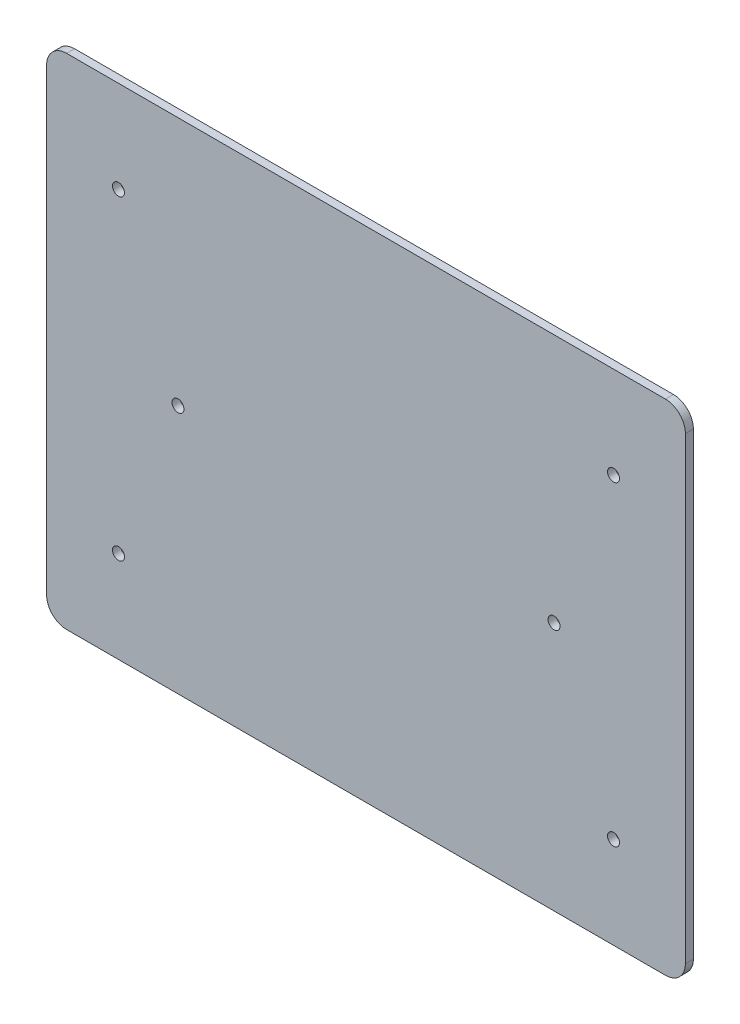
ISO-10303-21;
HEADER;
FILE_DESCRIPTION(('STEP AP214'),'2;1');
FILE_NAME('part.step','',(''),(''),'','','');
FILE_SCHEMA(('AUTOMOTIVE_DESIGN { 1 0 10303 214 1 1 1 1 }'));
ENDSEC;
DATA;
#1=APPLICATION_CONTEXT('core data for automotive mechanical design processes');
#2=APPLICATION_PROTOCOL_DEFINITION('international standard','automotive_design',2000,#1);
#3=PRODUCT_CONTEXT('',#1,'mechanical');
#4=PRODUCT('Part','Part','',(#3));
#5=PRODUCT_RELATED_PRODUCT_CATEGORY('part','',(#4));
#6=PRODUCT_DEFINITION_FORMATION('','',#4);
#7=PRODUCT_DEFINITION_CONTEXT('part definition',#1,'design');
#8=PRODUCT_DEFINITION('design','',#6,#7);
#9=PRODUCT_DEFINITION_SHAPE('','',#8);
#10=(LENGTH_UNIT() NAMED_UNIT(*) SI_UNIT(.MILLI.,.METRE.));
#11=(NAMED_UNIT(*) PLANE_ANGLE_UNIT() SI_UNIT($,.RADIAN.));
#12=(NAMED_UNIT(*) SI_UNIT($,.STERADIAN.) SOLID_ANGLE_UNIT());
#13=UNCERTAINTY_MEASURE_WITH_UNIT(LENGTH_MEASURE(1.E-05),#10,'distance_accuracy_value','');
#14=(GEOMETRIC_REPRESENTATION_CONTEXT(3) GLOBAL_UNCERTAINTY_ASSIGNED_CONTEXT((#13)) GLOBAL_UNIT_ASSIGNED_CONTEXT((#10,
#11,#12)) REPRESENTATION_CONTEXT('',''));
#15=CARTESIAN_POINT('',(0.,0.,0.));
#16=DIRECTION('',(0.,0.,1.));
#17=DIRECTION('',(1.,0.,0.));
#18=AXIS2_PLACEMENT_3D('',#15,#16,#17);
#19=CARTESIAN_POINT('',(-102.632364328177,-143.027068540586,2.));
#20=DIRECTION('',(0.,0.,-1.));
#21=DIRECTION('',(-1.,0.,0.));
#22=AXIS2_PLACEMENT_3D('',#19,#20,#21);
#23=CYLINDRICAL_SURFACE('',#22,5.);
#24=CARTESIAN_POINT('',(-102.632364328177,-143.027068540586,0.));
#25=DIRECTION('',(0.,0.,1.));
#26=DIRECTION('',(-1.,0.,0.));
#27=AXIS2_PLACEMENT_3D('',#24,#25,#26);
#28=CIRCLE('',#27,5.);
#29=CARTESIAN_POINT('',(-107.632364328177,-143.027068540586,0.));
#30=VERTEX_POINT('',#29);
#31=CARTESIAN_POINT('',(-102.632364328177,-148.027068540586,0.));
#32=VERTEX_POINT('',#31);
#33=EDGE_CURVE('E128',#30,#32,#28,.T.);
#34=ORIENTED_EDGE('',*,*,#33,.T.);
#35=DIRECTION('',(0.,0.,-1.));
#36=VECTOR('',#35,1.);
#37=CARTESIAN_POINT('',(-102.632364328177,-148.027068540586,2.));
#38=LINE('',#37,#36);
#39=CARTESIAN_POINT('',(-102.632364328177,-148.027068540586,2.));
#40=VERTEX_POINT('',#39);
#41=EDGE_CURVE('E11',#40,#32,#38,.T.);
#42=ORIENTED_EDGE('',*,*,#41,.F.);
#43=CARTESIAN_POINT('',(-102.632364328177,-143.027068540586,2.));
#44=DIRECTION('',(0.,0.,1.));
#45=DIRECTION('',(-1.,0.,0.));
#46=AXIS2_PLACEMENT_3D('',#43,#44,#45);
#47=CIRCLE('',#46,5.);
#48=CARTESIAN_POINT('',(-107.632364328177,-143.027068540586,2.));
#49=VERTEX_POINT('',#48);
#50=EDGE_CURVE('E143',#49,#40,#47,.T.);
#51=ORIENTED_EDGE('',*,*,#50,.F.);
#52=DIRECTION('',(0.,0.,-1.));
#53=VECTOR('',#52,1.);
#54=CARTESIAN_POINT('',(-107.632364328177,-143.027068540586,2.));
#55=LINE('',#54,#53);
#56=EDGE_CURVE('E124',#49,#30,#55,.T.);
#57=ORIENTED_EDGE('',*,*,#56,.T.);
#58=EDGE_LOOP('',(#34,#42,#51,#57));
#59=FACE_BOUND('',#58,.T.);
#60=ADVANCED_FACE('F32',(#59),#23,.T.);
#61=CARTESIAN_POINT('',(47.367635671823,-148.027068540586,2.));
#62=DIRECTION('',(0.,1.,0.));
#63=DIRECTION('',(0.,0.,1.));
#64=AXIS2_PLACEMENT_3D('',#61,#62,#63);
#65=PLANE('',#64);
#66=DIRECTION('',(1.,0.,0.));
#67=VECTOR('',#66,1.);
#68=CARTESIAN_POINT('',(47.367635671823,-148.027068540586,0.));
#69=LINE('',#68,#67);
#70=CARTESIAN_POINT('',(47.367635671823,-148.027068540586,0.));
#71=VERTEX_POINT('',#70);
#72=EDGE_CURVE('E131',#32,#71,#69,.T.);
#73=ORIENTED_EDGE('',*,*,#72,.T.);
#74=DIRECTION('',(0.,0.,-1.));
#75=VECTOR('',#74,1.);
#76=CARTESIAN_POINT('',(47.367635671823,-148.027068540586,2.));
#77=LINE('',#76,#75);
#78=CARTESIAN_POINT('',(47.367635671823,-148.027068540586,2.));
#79=VERTEX_POINT('',#78);
#80=EDGE_CURVE('E40',#79,#71,#77,.T.);
#81=ORIENTED_EDGE('',*,*,#80,.F.);
#82=DIRECTION('',(1.,0.,0.));
#83=VECTOR('',#82,1.);
#84=CARTESIAN_POINT('',(47.367635671823,-148.027068540586,2.));
#85=LINE('',#84,#83);
#86=EDGE_CURVE('E91',#40,#79,#85,.T.);
#87=ORIENTED_EDGE('',*,*,#86,.F.);
#88=ORIENTED_EDGE('',*,*,#41,.T.);
#89=EDGE_LOOP('',(#73,#81,#87,#88));
#90=FACE_BOUND('',#89,.T.);
#91=ADVANCED_FACE('F245',(#90),#65,.F.);
#92=CARTESIAN_POINT('',(47.3676356718231,-143.027068540586,2.));
#93=DIRECTION('',(0.,0.,-1.));
#94=DIRECTION('',(-1.,0.,0.));
#95=AXIS2_PLACEMENT_3D('',#92,#93,#94);
#96=CYLINDRICAL_SURFACE('',#95,5.);
#97=CARTESIAN_POINT('',(47.3676356718231,-143.027068540586,0.));
#98=DIRECTION('',(0.,0.,1.));
#99=DIRECTION('',(1.,0.,0.));
#100=AXIS2_PLACEMENT_3D('',#97,#98,#99);
#101=CIRCLE('',#100,5.);
#102=CARTESIAN_POINT('',(52.3676356718231,-143.027068540586,0.));
#103=VERTEX_POINT('',#102);
#104=EDGE_CURVE('E134',#71,#103,#101,.T.);
#105=ORIENTED_EDGE('',*,*,#104,.T.);
#106=DIRECTION('',(0.,0.,-1.));
#107=VECTOR('',#106,1.);
#108=CARTESIAN_POINT('',(52.3676356718231,-143.027068540586,2.));
#109=LINE('',#108,#107);
#110=CARTESIAN_POINT('',(52.3676356718231,-143.027068540586,2.));
#111=VERTEX_POINT('',#110);
#112=EDGE_CURVE('E150',#111,#103,#109,.T.);
#113=ORIENTED_EDGE('',*,*,#112,.F.);
#114=CARTESIAN_POINT('',(47.3676356718231,-143.027068540586,2.));
#115=DIRECTION('',(0.,0.,1.));
#116=DIRECTION('',(1.,0.,0.));
#117=AXIS2_PLACEMENT_3D('',#114,#115,#116);
#118=CIRCLE('',#117,5.);
#119=EDGE_CURVE('E158',#79,#111,#118,.T.);
#120=ORIENTED_EDGE('',*,*,#119,.F.);
#121=ORIENTED_EDGE('',*,*,#80,.T.);
#122=EDGE_LOOP('',(#105,#113,#120,#121));
#123=FACE_BOUND('',#122,.T.);
#124=ADVANCED_FACE('F156',(#123),#96,.T.);
#125=CARTESIAN_POINT('',(52.3676356718231,-143.027068540586,2.));
#126=DIRECTION('',(-1.,0.,0.));
#127=DIRECTION('',(0.,-1.,0.));
#128=AXIS2_PLACEMENT_3D('',#125,#126,#127);
#129=PLANE('',#128);
#130=DIRECTION('',(0.,1.,0.));
#131=VECTOR('',#130,1.);
#132=CARTESIAN_POINT('',(52.3676356718231,-143.027068540586,0.));
#133=LINE('',#132,#131);
#134=CARTESIAN_POINT('',(52.3676356718231,-28.0270685405863,0.));
#135=VERTEX_POINT('',#134);
#136=EDGE_CURVE('E136',#103,#135,#133,.T.);
#137=ORIENTED_EDGE('',*,*,#136,.T.);
#138=DIRECTION('',(0.,0.,-1.));
#139=VECTOR('',#138,1.);
#140=CARTESIAN_POINT('',(52.3676356718231,-28.0270685405863,2.));
#141=LINE('',#140,#139);
#142=CARTESIAN_POINT('',(52.3676356718231,-28.0270685405863,2.));
#143=VERTEX_POINT('',#142);
#144=EDGE_CURVE('E147',#143,#135,#141,.T.);
#145=ORIENTED_EDGE('',*,*,#144,.F.);
#146=DIRECTION('',(0.,1.,0.));
#147=VECTOR('',#146,1.);
#148=CARTESIAN_POINT('',(52.3676356718231,-143.027068540586,2.));
#149=LINE('',#148,#147);
#150=EDGE_CURVE('E170',#111,#143,#149,.T.);
#151=ORIENTED_EDGE('',*,*,#150,.F.);
#152=ORIENTED_EDGE('',*,*,#112,.T.);
#153=EDGE_LOOP('',(#137,#145,#151,#152));
#154=FACE_BOUND('',#153,.T.);
#155=ADVANCED_FACE('F166',(#154),#129,.F.);
#156=CARTESIAN_POINT('',(47.3676356718231,-28.0270685405863,2.));
#157=DIRECTION('',(0.,0.,-1.));
#158=DIRECTION('',(-1.,0.,0.));
#159=AXIS2_PLACEMENT_3D('',#156,#157,#158);
#160=CYLINDRICAL_SURFACE('',#159,5.);
#161=CARTESIAN_POINT('',(47.3676356718231,-28.0270685405863,0.));
#162=DIRECTION('',(0.,0.,1.));
#163=DIRECTION('',(1.,0.,0.));
#164=AXIS2_PLACEMENT_3D('',#161,#162,#163);
#165=CIRCLE('',#164,5.);
#166=CARTESIAN_POINT('',(47.3676356718231,-23.0270685405863,0.));
#167=VERTEX_POINT('',#166);
#168=EDGE_CURVE('E138',#135,#167,#165,.T.);
#169=ORIENTED_EDGE('',*,*,#168,.T.);
#170=DIRECTION('',(0.,0.,-1.));
#171=VECTOR('',#170,1.);
#172=CARTESIAN_POINT('',(47.3676356718231,-23.0270685405863,2.));
#173=LINE('',#172,#171);
#174=CARTESIAN_POINT('',(47.3676356718231,-23.0270685405863,2.));
#175=VERTEX_POINT('',#174);
#176=EDGE_CURVE('E119',#175,#167,#173,.T.);
#177=ORIENTED_EDGE('',*,*,#176,.F.);
#178=CARTESIAN_POINT('',(47.3676356718231,-28.0270685405863,2.));
#179=DIRECTION('',(0.,0.,1.));
#180=DIRECTION('',(1.,0.,0.));
#181=AXIS2_PLACEMENT_3D('',#178,#179,#180);
#182=CIRCLE('',#181,5.);
#183=EDGE_CURVE('E110',#143,#175,#182,.T.);
#184=ORIENTED_EDGE('',*,*,#183,.F.);
#185=ORIENTED_EDGE('',*,*,#144,.T.);
#186=EDGE_LOOP('',(#169,#177,#184,#185));
#187=FACE_BOUND('',#186,.T.);
#188=ADVANCED_FACE('F169',(#187),#160,.T.);
#189=CARTESIAN_POINT('',(47.3676356718231,-23.0270685405863,2.));
#190=DIRECTION('',(0.,-1.,0.));
#191=DIRECTION('',(1.,0.,0.));
#192=AXIS2_PLACEMENT_3D('',#189,#190,#191);
#193=PLANE('',#192);
#194=DIRECTION('',(-1.,0.,0.));
#195=VECTOR('',#194,1.);
#196=CARTESIAN_POINT('',(47.3676356718231,-23.0270685405863,0.));
#197=LINE('',#196,#195);
#198=CARTESIAN_POINT('',(-102.632364328177,-23.0270685405863,0.));
#199=VERTEX_POINT('',#198);
#200=EDGE_CURVE('E118',#167,#199,#197,.T.);
#201=ORIENTED_EDGE('',*,*,#200,.T.);
#202=DIRECTION('',(0.,0.,-1.));
#203=VECTOR('',#202,1.);
#204=CARTESIAN_POINT('',(-102.632364328177,-23.0270685405863,2.));
#205=LINE('',#204,#203);
#206=CARTESIAN_POINT('',(-102.632364328177,-23.0270685405863,2.));
#207=VERTEX_POINT('',#206);
#208=EDGE_CURVE('E115',#207,#199,#205,.T.);
#209=ORIENTED_EDGE('',*,*,#208,.F.);
#210=DIRECTION('',(-1.,0.,0.));
#211=VECTOR('',#210,1.);
#212=CARTESIAN_POINT('',(47.3676356718231,-23.0270685405863,2.));
#213=LINE('',#212,#211);
#214=EDGE_CURVE('E104',#175,#207,#213,.T.);
#215=ORIENTED_EDGE('',*,*,#214,.F.);
#216=ORIENTED_EDGE('',*,*,#176,.T.);
#217=EDGE_LOOP('',(#201,#209,#215,#216));
#218=FACE_BOUND('',#217,.T.);
#219=ADVANCED_FACE('F116',(#218),#193,.F.);
#220=CARTESIAN_POINT('',(-102.632364328177,-28.0270685405863,2.));
#221=DIRECTION('',(0.,0.,-1.));
#222=DIRECTION('',(-1.,0.,0.));
#223=AXIS2_PLACEMENT_3D('',#220,#221,#222);
#224=CYLINDRICAL_SURFACE('',#223,5.);
#225=CARTESIAN_POINT('',(-102.632364328177,-28.0270685405863,0.));
#226=DIRECTION('',(0.,0.,1.));
#227=DIRECTION('',(1.,0.,0.));
#228=AXIS2_PLACEMENT_3D('',#225,#226,#227);
#229=CIRCLE('',#228,5.);
#230=CARTESIAN_POINT('',(-107.632364328177,-28.0270685405863,0.));
#231=VERTEX_POINT('',#230);
#232=EDGE_CURVE('E77',#199,#231,#229,.T.);
#233=ORIENTED_EDGE('',*,*,#232,.T.);
#234=DIRECTION('',(0.,0.,-1.));
#235=VECTOR('',#234,1.);
#236=CARTESIAN_POINT('',(-107.632364328177,-28.0270685405863,2.));
#237=LINE('',#236,#235);
#238=CARTESIAN_POINT('',(-107.632364328177,-28.0270685405863,2.));
#239=VERTEX_POINT('',#238);
#240=EDGE_CURVE('E120',#239,#231,#237,.T.);
#241=ORIENTED_EDGE('',*,*,#240,.F.);
#242=CARTESIAN_POINT('',(-102.632364328177,-28.0270685405863,2.));
#243=DIRECTION('',(0.,0.,1.));
#244=DIRECTION('',(1.,0.,0.));
#245=AXIS2_PLACEMENT_3D('',#242,#243,#244);
#246=CIRCLE('',#245,5.);
#247=EDGE_CURVE('E108',#207,#239,#246,.T.);
#248=ORIENTED_EDGE('',*,*,#247,.F.);
#249=ORIENTED_EDGE('',*,*,#208,.T.);
#250=EDGE_LOOP('',(#233,#241,#248,#249));
#251=FACE_BOUND('',#250,.T.);
#252=ADVANCED_FACE('F122',(#251),#224,.T.);
#253=CARTESIAN_POINT('',(-107.632364328177,-143.027068540586,2.));
#254=DIRECTION('',(1.,0.,0.));
#255=DIRECTION('',(0.,0.,-1.));
#256=AXIS2_PLACEMENT_3D('',#253,#254,#255);
#257=PLANE('',#256);
#258=DIRECTION('',(0.,-1.,0.));
#259=VECTOR('',#258,1.);
#260=CARTESIAN_POINT('',(-107.632364328177,-143.027068540586,0.));
#261=LINE('',#260,#259);
#262=EDGE_CURVE('E83',#231,#30,#261,.T.);
#263=ORIENTED_EDGE('',*,*,#262,.T.);
#264=ORIENTED_EDGE('',*,*,#56,.F.);
#265=DIRECTION('',(0.,-1.,0.));
#266=VECTOR('',#265,1.);
#267=CARTESIAN_POINT('',(-107.632364328177,-143.027068540586,2.));
#268=LINE('',#267,#266);
#269=EDGE_CURVE('E48',#239,#49,#268,.T.);
#270=ORIENTED_EDGE('',*,*,#269,.F.);
#271=ORIENTED_EDGE('',*,*,#240,.T.);
#272=EDGE_LOOP('',(#263,#264,#270,#271));
#273=FACE_BOUND('',#272,.T.);
#274=ADVANCED_FACE('F236',(#273),#257,.F.);
#275=CARTESIAN_POINT('',(-102.632364328177,-143.027068540586,2.));
#276=DIRECTION('',(0.,0.,-1.));
#277=DIRECTION('',(-1.,0.,0.));
#278=AXIS2_PLACEMENT_3D('',#275,#276,#277);
#279=PLANE('',#278);
#280=CARTESIAN_POINT('',(19.4676356718231,-85.5270685405863,2.));
#281=DIRECTION('',(0.,0.,-1.));
#282=DIRECTION('',(-1.,0.,0.));
#283=AXIS2_PLACEMENT_3D('',#280,#281,#282);
#284=CIRCLE('',#283,1.5);
#285=CARTESIAN_POINT('',(17.9676356718231,-85.5270685405863,2.));
#286=VERTEX_POINT('',#285);
#287=EDGE_CURVE('E181',#286,#286,#284,.T.);
#288=ORIENTED_EDGE('',*,*,#287,.T.);
#289=EDGE_LOOP('',(#288));
#290=FACE_BOUND('',#289,.T.);
#291=CARTESIAN_POINT('',(34.3676356718231,-46.0270685405863,2.));
#292=DIRECTION('',(0.,0.,-1.));
#293=DIRECTION('',(-1.,0.,0.));
#294=AXIS2_PLACEMENT_3D('',#291,#292,#293);
#295=CIRCLE('',#294,1.5);
#296=CARTESIAN_POINT('',(32.8676356718231,-46.0270685405863,2.));
#297=VERTEX_POINT('',#296);
#298=EDGE_CURVE('E184',#297,#297,#295,.T.);
#299=ORIENTED_EDGE('',*,*,#298,.T.);
#300=EDGE_LOOP('',(#299));
#301=FACE_BOUND('',#300,.T.);
#302=CARTESIAN_POINT('',(-89.6323643281769,-46.0270685405863,2.));
#303=DIRECTION('',(0.,0.,-1.));
#304=DIRECTION('',(-1.,0.,0.));
#305=AXIS2_PLACEMENT_3D('',#302,#303,#304);
#306=CIRCLE('',#305,1.50000000000003);
#307=CARTESIAN_POINT('',(-91.1323643281769,-46.0270685405863,2.));
#308=VERTEX_POINT('',#307);
#309=EDGE_CURVE('E187',#308,#308,#306,.T.);
#310=ORIENTED_EDGE('',*,*,#309,.T.);
#311=EDGE_LOOP('',(#310));
#312=FACE_BOUND('',#311,.T.);
#313=CARTESIAN_POINT('',(-74.7323643281769,-85.5270685405863,2.));
#314=DIRECTION('',(0.,0.,-1.));
#315=DIRECTION('',(-1.,0.,0.));
#316=AXIS2_PLACEMENT_3D('',#313,#314,#315);
#317=CIRCLE('',#316,1.5);
#318=CARTESIAN_POINT('',(-76.2323643281769,-85.5270685405863,2.));
#319=VERTEX_POINT('',#318);
#320=EDGE_CURVE('E190',#319,#319,#317,.T.);
#321=ORIENTED_EDGE('',*,*,#320,.T.);
#322=EDGE_LOOP('',(#321));
#323=FACE_BOUND('',#322,.T.);
#324=CARTESIAN_POINT('',(-89.6323643281769,-125.027068540586,2.));
#325=DIRECTION('',(0.,0.,-1.));
#326=DIRECTION('',(-1.,0.,0.));
#327=AXIS2_PLACEMENT_3D('',#324,#325,#326);
#328=CIRCLE('',#327,1.50000000000003);
#329=CARTESIAN_POINT('',(-91.1323643281769,-125.027068540586,2.));
#330=VERTEX_POINT('',#329);
#331=EDGE_CURVE('E193',#330,#330,#328,.T.);
#332=ORIENTED_EDGE('',*,*,#331,.T.);
#333=EDGE_LOOP('',(#332));
#334=FACE_BOUND('',#333,.T.);
#335=CARTESIAN_POINT('',(34.3676356718231,-125.027068540586,2.));
#336=DIRECTION('',(0.,0.,-1.));
#337=DIRECTION('',(-1.,0.,0.));
#338=AXIS2_PLACEMENT_3D('',#335,#336,#337);
#339=CIRCLE('',#338,1.5);
#340=CARTESIAN_POINT('',(32.8676356718231,-125.027068540586,2.));
#341=VERTEX_POINT('',#340);
#342=EDGE_CURVE('E132',#341,#341,#339,.T.);
#343=ORIENTED_EDGE('',*,*,#342,.T.);
#344=EDGE_LOOP('',(#343));
#345=FACE_BOUND('',#344,.T.);
#346=ORIENTED_EDGE('',*,*,#50,.T.);
#347=ORIENTED_EDGE('',*,*,#86,.T.);
#348=ORIENTED_EDGE('',*,*,#119,.T.);
#349=ORIENTED_EDGE('',*,*,#150,.T.);
#350=ORIENTED_EDGE('',*,*,#183,.T.);
#351=ORIENTED_EDGE('',*,*,#214,.T.);
#352=ORIENTED_EDGE('',*,*,#247,.T.);
#353=ORIENTED_EDGE('',*,*,#269,.T.);
#354=EDGE_LOOP('',(#346,#347,#348,#349,#350,#351,#352,#353));
#355=FACE_BOUND('',#354,.T.);
#356=ADVANCED_FACE('F106',(#290,#301,#312,#323,#334,#345,#355),#279,.F.);
#357=CARTESIAN_POINT('',(-102.632364328177,-143.027068540586,0.));
#358=DIRECTION('',(0.,0.,-1.));
#359=DIRECTION('',(-1.,0.,0.));
#360=AXIS2_PLACEMENT_3D('',#357,#358,#359);
#361=PLANE('',#360);
#362=CARTESIAN_POINT('',(19.4676356718231,-85.5270685405863,0.));
#363=DIRECTION('',(0.,0.,-1.));
#364=DIRECTION('',(-1.,0.,0.));
#365=AXIS2_PLACEMENT_3D('',#362,#363,#364);
#366=CIRCLE('',#365,1.5);
#367=CARTESIAN_POINT('',(17.9676356718231,-85.5270685405863,0.));
#368=VERTEX_POINT('',#367);
#369=EDGE_CURVE('E196',#368,#368,#366,.T.);
#370=ORIENTED_EDGE('',*,*,#369,.F.);
#371=EDGE_LOOP('',(#370));
#372=FACE_BOUND('',#371,.T.);
#373=CARTESIAN_POINT('',(34.3676356718231,-46.0270685405863,0.));
#374=DIRECTION('',(0.,0.,-1.));
#375=DIRECTION('',(-1.,0.,0.));
#376=AXIS2_PLACEMENT_3D('',#373,#374,#375);
#377=CIRCLE('',#376,1.5);
#378=CARTESIAN_POINT('',(32.8676356718231,-46.0270685405863,0.));
#379=VERTEX_POINT('',#378);
#380=EDGE_CURVE('E206',#379,#379,#377,.T.);
#381=ORIENTED_EDGE('',*,*,#380,.F.);
#382=EDGE_LOOP('',(#381));
#383=FACE_BOUND('',#382,.T.);
#384=CARTESIAN_POINT('',(-89.6323643281769,-46.0270685405863,0.));
#385=DIRECTION('',(0.,0.,-1.));
#386=DIRECTION('',(1.,0.,0.));
#387=AXIS2_PLACEMENT_3D('',#384,#385,#386);
#388=CIRCLE('',#387,1.50000000000003);
#389=CARTESIAN_POINT('',(-88.1323643281769,-46.0270685405863,0.));
#390=VERTEX_POINT('',#389);
#391=EDGE_CURVE('E203',#390,#390,#388,.T.);
#392=ORIENTED_EDGE('',*,*,#391,.F.);
#393=EDGE_LOOP('',(#392));
#394=FACE_BOUND('',#393,.T.);
#395=CARTESIAN_POINT('',(-74.7323643281769,-85.5270685405863,0.));
#396=DIRECTION('',(0.,0.,-1.));
#397=DIRECTION('',(1.,0.,0.));
#398=AXIS2_PLACEMENT_3D('',#395,#396,#397);
#399=CIRCLE('',#398,1.5);
#400=CARTESIAN_POINT('',(-73.2323643281769,-85.5270685405863,0.));
#401=VERTEX_POINT('',#400);
#402=EDGE_CURVE('E200',#401,#401,#399,.T.);
#403=ORIENTED_EDGE('',*,*,#402,.F.);
#404=EDGE_LOOP('',(#403));
#405=FACE_BOUND('',#404,.T.);
#406=CARTESIAN_POINT('',(-89.6323643281769,-125.027068540586,0.));
#407=DIRECTION('',(0.,0.,-1.));
#408=DIRECTION('',(1.,0.,0.));
#409=AXIS2_PLACEMENT_3D('',#406,#407,#408);
#410=CIRCLE('',#409,1.50000000000003);
#411=CARTESIAN_POINT('',(-88.1323643281769,-125.027068540586,0.));
#412=VERTEX_POINT('',#411);
#413=EDGE_CURVE('E197',#412,#412,#410,.T.);
#414=ORIENTED_EDGE('',*,*,#413,.F.);
#415=EDGE_LOOP('',(#414));
#416=FACE_BOUND('',#415,.T.);
#417=CARTESIAN_POINT('',(34.3676356718231,-125.027068540586,0.));
#418=DIRECTION('',(0.,0.,-1.));
#419=DIRECTION('',(-1.,0.,0.));
#420=AXIS2_PLACEMENT_3D('',#417,#418,#419);
#421=CIRCLE('',#420,1.5);
#422=CARTESIAN_POINT('',(32.8676356718231,-125.027068540586,0.));
#423=VERTEX_POINT('',#422);
#424=EDGE_CURVE('E178',#423,#423,#421,.T.);
#425=ORIENTED_EDGE('',*,*,#424,.F.);
#426=EDGE_LOOP('',(#425));
#427=FACE_BOUND('',#426,.T.);
#428=ORIENTED_EDGE('',*,*,#33,.F.);
#429=ORIENTED_EDGE('',*,*,#262,.F.);
#430=ORIENTED_EDGE('',*,*,#232,.F.);
#431=ORIENTED_EDGE('',*,*,#200,.F.);
#432=ORIENTED_EDGE('',*,*,#168,.F.);
#433=ORIENTED_EDGE('',*,*,#136,.F.);
#434=ORIENTED_EDGE('',*,*,#104,.F.);
#435=ORIENTED_EDGE('',*,*,#72,.F.);
#436=EDGE_LOOP('',(#428,#429,#430,#431,#432,#433,#434,#435));
#437=FACE_BOUND('',#436,.T.);
#438=ADVANCED_FACE('F162',(#372,#383,#394,#405,#416,#427,#437),#361,.T.);
#439=CARTESIAN_POINT('',(34.3676356718231,-125.027068540586,10.));
#440=DIRECTION('',(0.,0.,-1.));
#441=DIRECTION('',(-1.,0.,0.));
#442=AXIS2_PLACEMENT_3D('',#439,#440,#441);
#443=CYLINDRICAL_SURFACE('',#442,1.5);
#444=ORIENTED_EDGE('',*,*,#424,.T.);
#445=EDGE_LOOP('',(#444));
#446=FACE_BOUND('',#445,.T.);
#447=ORIENTED_EDGE('',*,*,#342,.F.);
#448=EDGE_LOOP('',(#447));
#449=FACE_BOUND('',#448,.T.);
#450=ADVANCED_FACE('F217',(#446,#449),#443,.F.);
#451=CARTESIAN_POINT('',(-89.6323643281769,-125.027068540586,10.));
#452=DIRECTION('',(0.,0.,-1.));
#453=DIRECTION('',(-1.,0.,0.));
#454=AXIS2_PLACEMENT_3D('',#451,#452,#453);
#455=CYLINDRICAL_SURFACE('',#454,1.50000000000003);
#456=ORIENTED_EDGE('',*,*,#413,.T.);
#457=EDGE_LOOP('',(#456));
#458=FACE_BOUND('',#457,.T.);
#459=ORIENTED_EDGE('',*,*,#331,.F.);
#460=EDGE_LOOP('',(#459));
#461=FACE_BOUND('',#460,.T.);
#462=ADVANCED_FACE('F231',(#458,#461),#455,.F.);
#463=CARTESIAN_POINT('',(-74.7323643281769,-85.5270685405863,10.));
#464=DIRECTION('',(0.,0.,-1.));
#465=DIRECTION('',(-1.,0.,0.));
#466=AXIS2_PLACEMENT_3D('',#463,#464,#465);
#467=CYLINDRICAL_SURFACE('',#466,1.5);
#468=ORIENTED_EDGE('',*,*,#402,.T.);
#469=EDGE_LOOP('',(#468));
#470=FACE_BOUND('',#469,.T.);
#471=ORIENTED_EDGE('',*,*,#320,.F.);
#472=EDGE_LOOP('',(#471));
#473=FACE_BOUND('',#472,.T.);
#474=ADVANCED_FACE('F297',(#470,#473),#467,.F.);
#475=CARTESIAN_POINT('',(-89.6323643281769,-46.0270685405863,10.));
#476=DIRECTION('',(0.,0.,-1.));
#477=DIRECTION('',(-1.,0.,0.));
#478=AXIS2_PLACEMENT_3D('',#475,#476,#477);
#479=CYLINDRICAL_SURFACE('',#478,1.50000000000003);
#480=ORIENTED_EDGE('',*,*,#391,.T.);
#481=EDGE_LOOP('',(#480));
#482=FACE_BOUND('',#481,.T.);
#483=ORIENTED_EDGE('',*,*,#309,.F.);
#484=EDGE_LOOP('',(#483));
#485=FACE_BOUND('',#484,.T.);
#486=ADVANCED_FACE('F307',(#482,#485),#479,.F.);
#487=CARTESIAN_POINT('',(34.3676356718231,-46.0270685405863,10.));
#488=DIRECTION('',(0.,0.,-1.));
#489=DIRECTION('',(-1.,0.,0.));
#490=AXIS2_PLACEMENT_3D('',#487,#488,#489);
#491=CYLINDRICAL_SURFACE('',#490,1.5);
#492=ORIENTED_EDGE('',*,*,#380,.T.);
#493=EDGE_LOOP('',(#492));
#494=FACE_BOUND('',#493,.T.);
#495=ORIENTED_EDGE('',*,*,#298,.F.);
#496=EDGE_LOOP('',(#495));
#497=FACE_BOUND('',#496,.T.);
#498=ADVANCED_FACE('F317',(#494,#497),#491,.F.);
#499=CARTESIAN_POINT('',(19.4676356718231,-85.5270685405863,10.));
#500=DIRECTION('',(0.,0.,-1.));
#501=DIRECTION('',(-1.,0.,0.));
#502=AXIS2_PLACEMENT_3D('',#499,#500,#501);
#503=CYLINDRICAL_SURFACE('',#502,1.5);
#504=ORIENTED_EDGE('',*,*,#369,.T.);
#505=EDGE_LOOP('',(#504));
#506=FACE_BOUND('',#505,.T.);
#507=ORIENTED_EDGE('',*,*,#287,.F.);
#508=EDGE_LOOP('',(#507));
#509=FACE_BOUND('',#508,.T.);
#510=ADVANCED_FACE('F212',(#506,#509),#503,.F.);
#511=CLOSED_SHELL('',(#60,#91,#124,#155,#188,#219,#252,#274,#356,#438,#450,#462,#474,#486,#498,#510));
#512=MANIFOLD_SOLID_BREP('B2',#511);
#513=ADVANCED_BREP_SHAPE_REPRESENTATION('',(#18,#512),#14);
#514=SHAPE_DEFINITION_REPRESENTATION(#9,#513);
ENDSEC;
END-ISO-10303-21;
